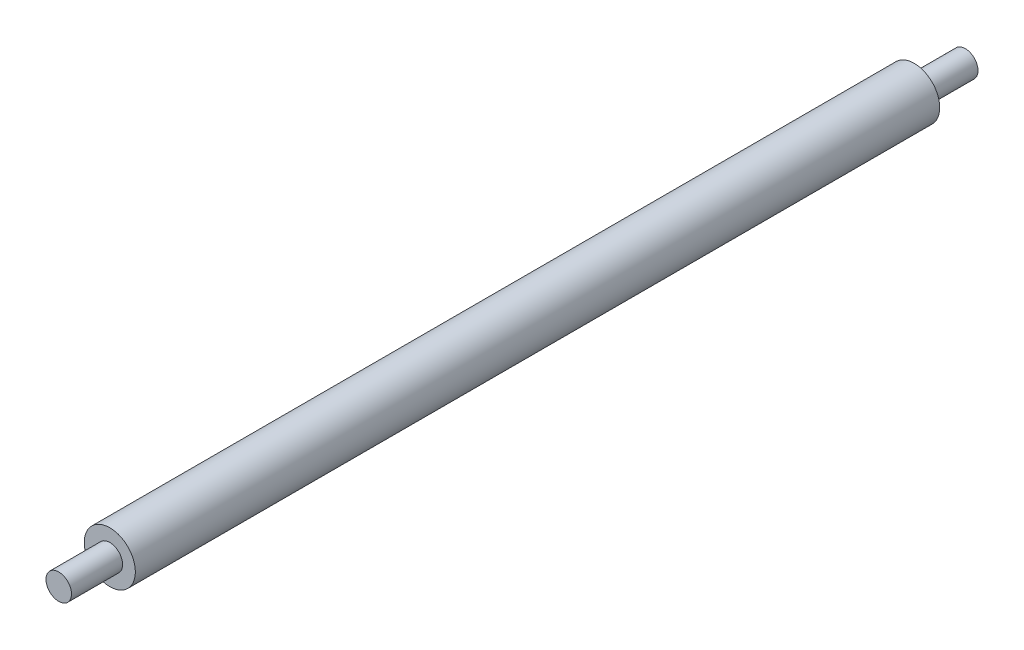
ISO-10303-21;
HEADER;
FILE_DESCRIPTION(('STEP AP214'),'2;1');
FILE_NAME('part.step','',(''),(''),'','','');
FILE_SCHEMA(('AUTOMOTIVE_DESIGN { 1 0 10303 214 1 1 1 1 }'));
ENDSEC;
DATA;
#1=APPLICATION_CONTEXT('core data for automotive mechanical design processes');
#2=APPLICATION_PROTOCOL_DEFINITION('international standard','automotive_design',2000,#1);
#3=PRODUCT_CONTEXT('',#1,'mechanical');
#4=PRODUCT('Part','Part','',(#3));
#5=PRODUCT_RELATED_PRODUCT_CATEGORY('part','',(#4));
#6=PRODUCT_DEFINITION_FORMATION('','',#4);
#7=PRODUCT_DEFINITION_CONTEXT('part definition',#1,'design');
#8=PRODUCT_DEFINITION('design','',#6,#7);
#9=PRODUCT_DEFINITION_SHAPE('','',#8);
#10=(LENGTH_UNIT() NAMED_UNIT(*) SI_UNIT(.MILLI.,.METRE.));
#11=(NAMED_UNIT(*) PLANE_ANGLE_UNIT() SI_UNIT($,.RADIAN.));
#12=(NAMED_UNIT(*) SI_UNIT($,.STERADIAN.) SOLID_ANGLE_UNIT());
#13=UNCERTAINTY_MEASURE_WITH_UNIT(LENGTH_MEASURE(1.E-05),#10,'distance_accuracy_value','');
#14=(GEOMETRIC_REPRESENTATION_CONTEXT(3) GLOBAL_UNCERTAINTY_ASSIGNED_CONTEXT((#13)) GLOBAL_UNIT_ASSIGNED_CONTEXT((#10,
#11,#12)) REPRESENTATION_CONTEXT('',''));
#15=CARTESIAN_POINT('',(0.,0.,0.));
#16=DIRECTION('',(0.,0.,1.));
#17=DIRECTION('',(1.,0.,0.));
#18=AXIS2_PLACEMENT_3D('',#15,#16,#17);
#19=CARTESIAN_POINT('',(0.,0.,315.));
#20=DIRECTION('',(0.,0.,-1.));
#21=DIRECTION('',(-1.,0.,0.));
#22=AXIS2_PLACEMENT_3D('',#19,#20,#21);
#23=CYLINDRICAL_SURFACE('',#22,10.);
#24=CARTESIAN_POINT('',(0.,0.,315.));
#25=DIRECTION('',(0.,0.,1.));
#26=DIRECTION('',(1.,0.,0.));
#27=AXIS2_PLACEMENT_3D('',#24,#25,#26);
#28=CIRCLE('',#27,10.);
#29=CARTESIAN_POINT('',(10.,0.,315.));
#30=VERTEX_POINT('',#29);
#31=EDGE_CURVE('E44',#30,#30,#28,.T.);
#32=ORIENTED_EDGE('',*,*,#31,.F.);
#33=EDGE_LOOP('',(#32));
#34=FACE_BOUND('',#33,.T.);
#35=CARTESIAN_POINT('',(0.,0.,0.));
#36=DIRECTION('',(0.,0.,1.));
#37=DIRECTION('',(1.,0.,0.));
#38=AXIS2_PLACEMENT_3D('',#35,#36,#37);
#39=CIRCLE('',#38,10.);
#40=CARTESIAN_POINT('',(10.,0.,0.));
#41=VERTEX_POINT('',#40);
#42=EDGE_CURVE('E35',#41,#41,#39,.T.);
#43=ORIENTED_EDGE('',*,*,#42,.T.);
#44=EDGE_LOOP('',(#43));
#45=FACE_BOUND('',#44,.T.);
#46=ADVANCED_FACE('F32',(#34,#45),#23,.T.);
#47=CARTESIAN_POINT('',(0.,0.,315.));
#48=DIRECTION('',(0.,0.,1.));
#49=DIRECTION('',(1.,0.,0.));
#50=AXIS2_PLACEMENT_3D('',#47,#48,#49);
#51=PLANE('',#50);
#52=CARTESIAN_POINT('',(0.,0.,315.));
#53=DIRECTION('',(0.,0.,1.));
#54=DIRECTION('',(1.,0.,0.));
#55=AXIS2_PLACEMENT_3D('',#52,#53,#54);
#56=CIRCLE('',#55,5.);
#57=CARTESIAN_POINT('',(5.,0.,315.));
#58=VERTEX_POINT('',#57);
#59=EDGE_CURVE('E39',#58,#58,#56,.T.);
#60=ORIENTED_EDGE('',*,*,#59,.F.);
#61=EDGE_LOOP('',(#60));
#62=FACE_BOUND('',#61,.T.);
#63=ORIENTED_EDGE('',*,*,#31,.T.);
#64=EDGE_LOOP('',(#63));
#65=FACE_BOUND('',#64,.T.);
#66=ADVANCED_FACE('F61',(#62,#65),#51,.T.);
#67=CARTESIAN_POINT('',(0.,0.,0.));
#68=DIRECTION('',(0.,0.,1.));
#69=DIRECTION('',(1.,0.,0.));
#70=AXIS2_PLACEMENT_3D('',#67,#68,#69);
#71=PLANE('',#70);
#72=CARTESIAN_POINT('',(0.,0.,0.));
#73=DIRECTION('',(0.,0.,-1.));
#74=DIRECTION('',(-1.,0.,0.));
#75=AXIS2_PLACEMENT_3D('',#72,#73,#74);
#76=CIRCLE('',#75,5.);
#77=CARTESIAN_POINT('',(-5.,0.,0.));
#78=VERTEX_POINT('',#77);
#79=EDGE_CURVE('E10',#78,#78,#76,.T.);
#80=ORIENTED_EDGE('',*,*,#79,.F.);
#81=EDGE_LOOP('',(#80));
#82=FACE_BOUND('',#81,.T.);
#83=ORIENTED_EDGE('',*,*,#42,.F.);
#84=EDGE_LOOP('',(#83));
#85=FACE_BOUND('',#84,.T.);
#86=ADVANCED_FACE('F58',(#82,#85),#71,.F.);
#87=CARTESIAN_POINT('',(0.,0.,335.));
#88=DIRECTION('',(0.,0.,-1.));
#89=DIRECTION('',(-1.,0.,0.));
#90=AXIS2_PLACEMENT_3D('',#87,#88,#89);
#91=CYLINDRICAL_SURFACE('',#90,5.);
#92=CARTESIAN_POINT('',(0.,0.,335.));
#93=DIRECTION('',(0.,0.,1.));
#94=DIRECTION('',(1.,0.,0.));
#95=AXIS2_PLACEMENT_3D('',#92,#93,#94);
#96=CIRCLE('',#95,5.);
#97=CARTESIAN_POINT('',(5.,0.,335.));
#98=VERTEX_POINT('',#97);
#99=EDGE_CURVE('E49',#98,#98,#96,.T.);
#100=ORIENTED_EDGE('',*,*,#99,.F.);
#101=EDGE_LOOP('',(#100));
#102=FACE_BOUND('',#101,.T.);
#103=ORIENTED_EDGE('',*,*,#59,.T.);
#104=EDGE_LOOP('',(#103));
#105=FACE_BOUND('',#104,.T.);
#106=ADVANCED_FACE('F60',(#102,#105),#91,.T.);
#107=CARTESIAN_POINT('',(0.,0.,335.));
#108=DIRECTION('',(0.,0.,1.));
#109=DIRECTION('',(1.,0.,0.));
#110=AXIS2_PLACEMENT_3D('',#107,#108,#109);
#111=PLANE('',#110);
#112=ORIENTED_EDGE('',*,*,#99,.T.);
#113=EDGE_LOOP('',(#112));
#114=FACE_BOUND('',#113,.T.);
#115=ADVANCED_FACE('F67',(#114),#111,.T.);
#116=CARTESIAN_POINT('',(0.,0.,-20.));
#117=DIRECTION('',(0.,0.,1.));
#118=DIRECTION('',(1.,0.,0.));
#119=AXIS2_PLACEMENT_3D('',#116,#117,#118);
#120=CYLINDRICAL_SURFACE('',#119,5.);
#121=CARTESIAN_POINT('',(0.,0.,-20.));
#122=DIRECTION('',(0.,0.,-1.));
#123=DIRECTION('',(-1.,0.,0.));
#124=AXIS2_PLACEMENT_3D('',#121,#122,#123);
#125=CIRCLE('',#124,5.);
#126=CARTESIAN_POINT('',(-5.,0.,-20.));
#127=VERTEX_POINT('',#126);
#128=EDGE_CURVE('E48',#127,#127,#125,.T.);
#129=ORIENTED_EDGE('',*,*,#128,.F.);
#130=EDGE_LOOP('',(#129));
#131=FACE_BOUND('',#130,.T.);
#132=ORIENTED_EDGE('',*,*,#79,.T.);
#133=EDGE_LOOP('',(#132));
#134=FACE_BOUND('',#133,.T.);
#135=ADVANCED_FACE('F97',(#131,#134),#120,.T.);
#136=CARTESIAN_POINT('',(0.,0.,-20.));
#137=DIRECTION('',(0.,0.,-1.));
#138=DIRECTION('',(-1.,0.,0.));
#139=AXIS2_PLACEMENT_3D('',#136,#137,#138);
#140=PLANE('',#139);
#141=ORIENTED_EDGE('',*,*,#128,.T.);
#142=EDGE_LOOP('',(#141));
#143=FACE_BOUND('',#142,.T.);
#144=ADVANCED_FACE('F102',(#143),#140,.T.);
#145=CLOSED_SHELL('',(#46,#66,#86,#106,#115,#135,#144));
#146=MANIFOLD_SOLID_BREP('B2',#145);
#147=ADVANCED_BREP_SHAPE_REPRESENTATION('',(#18,#146),#14);
#148=SHAPE_DEFINITION_REPRESENTATION(#9,#147);
ENDSEC;
END-ISO-10303-21;
